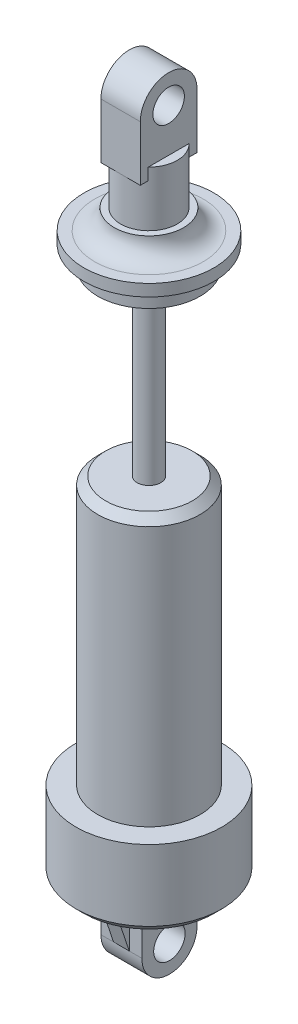
ISO-10303-21;
HEADER;
FILE_DESCRIPTION(('STEP AP214'),'2;1');
FILE_NAME('part.step','',(''),(''),'','','');
FILE_SCHEMA(('AUTOMOTIVE_DESIGN { 1 0 10303 214 1 1 1 1 }'));
ENDSEC;
DATA;
#1=APPLICATION_CONTEXT('core data for automotive mechanical design processes');
#2=APPLICATION_PROTOCOL_DEFINITION('international standard','automotive_design',2000,#1);
#3=PRODUCT_CONTEXT('',#1,'mechanical');
#4=PRODUCT('Part','Part','',(#3));
#5=PRODUCT_RELATED_PRODUCT_CATEGORY('part','',(#4));
#6=PRODUCT_DEFINITION_FORMATION('','',#4);
#7=PRODUCT_DEFINITION_CONTEXT('part definition',#1,'design');
#8=PRODUCT_DEFINITION('design','',#6,#7);
#9=PRODUCT_DEFINITION_SHAPE('','',#8);
#10=(LENGTH_UNIT() NAMED_UNIT(*) SI_UNIT(.MILLI.,.METRE.));
#11=(NAMED_UNIT(*) PLANE_ANGLE_UNIT() SI_UNIT($,.RADIAN.));
#12=(NAMED_UNIT(*) SI_UNIT($,.STERADIAN.) SOLID_ANGLE_UNIT());
#13=UNCERTAINTY_MEASURE_WITH_UNIT(LENGTH_MEASURE(1.E-05),#10,'distance_accuracy_value','');
#14=(GEOMETRIC_REPRESENTATION_CONTEXT(3) GLOBAL_UNCERTAINTY_ASSIGNED_CONTEXT((#13)) GLOBAL_UNIT_ASSIGNED_CONTEXT((#10,
#11,#12)) REPRESENTATION_CONTEXT('',''));
#15=CARTESIAN_POINT('',(0.,0.,0.));
#16=DIRECTION('',(0.,0.,1.));
#17=DIRECTION('',(1.,0.,0.));
#18=AXIS2_PLACEMENT_3D('',#15,#16,#17);
#19=CARTESIAN_POINT('',(0.,80.5,0.));
#20=DIRECTION('',(0.,-1.,0.));
#21=DIRECTION('',(0.,0.,-1.));
#22=AXIS2_PLACEMENT_3D('',#19,#20,#21);
#23=CYLINDRICAL_SURFACE('',#22,3.6);
#24=CARTESIAN_POINT('',(0.,73.5,0.));
#25=DIRECTION('',(0.,1.,0.));
#26=DIRECTION('',(0.,0.,1.));
#27=AXIS2_PLACEMENT_3D('',#24,#25,#26);
#28=CIRCLE('',#27,3.6);
#29=CARTESIAN_POINT('',(0.,73.5,3.6));
#30=VERTEX_POINT('',#29);
#31=EDGE_CURVE('E232',#30,#30,#28,.T.);
#32=ORIENTED_EDGE('',*,*,#31,.T.);
#33=EDGE_LOOP('',(#32));
#34=FACE_BOUND('',#33,.T.);
#35=CARTESIAN_POINT('',(0.,79.,0.));
#36=DIRECTION('',(0.,-1.,0.));
#37=DIRECTION('',(0.,0.,-1.));
#38=AXIS2_PLACEMENT_3D('',#35,#36,#37);
#39=CIRCLE('',#38,3.6);
#40=CARTESIAN_POINT('',(2.5,79.,2.59036676939772));
#41=VERTEX_POINT('',#40);
#42=CARTESIAN_POINT('',(0.,79.,3.6));
#43=VERTEX_POINT('',#42);
#44=EDGE_CURVE('E373',#41,#43,#39,.T.);
#45=ORIENTED_EDGE('',*,*,#44,.T.);
#46=CARTESIAN_POINT('',(-2.5,79.,2.59036676939772));
#47=VERTEX_POINT('',#46);
#48=EDGE_CURVE('E11',#43,#47,#39,.T.);
#49=ORIENTED_EDGE('',*,*,#48,.T.);
#50=DIRECTION('',(0.,-1.,0.));
#51=VECTOR('',#50,1.);
#52=CARTESIAN_POINT('',(-2.5,80.5,2.59036676939772));
#53=LINE('',#52,#51);
#54=CARTESIAN_POINT('',(-2.5,80.5,2.59036676939772));
#55=VERTEX_POINT('',#54);
#56=EDGE_CURVE('E230',#55,#47,#53,.T.);
#57=ORIENTED_EDGE('',*,*,#56,.F.);
#58=CARTESIAN_POINT('',(0.,80.5,0.));
#59=DIRECTION('',(0.,1.,0.));
#60=DIRECTION('',(0.,0.,1.));
#61=AXIS2_PLACEMENT_3D('',#58,#59,#60);
#62=CIRCLE('',#61,3.6);
#63=CARTESIAN_POINT('',(-2.5,80.5,-2.59036676939772));
#64=VERTEX_POINT('',#63);
#65=EDGE_CURVE('E233',#64,#55,#62,.T.);
#66=ORIENTED_EDGE('',*,*,#65,.F.);
#67=DIRECTION('',(0.,-1.,0.));
#68=VECTOR('',#67,1.);
#69=CARTESIAN_POINT('',(-2.5,80.5,-2.59036676939772));
#70=LINE('',#69,#68);
#71=CARTESIAN_POINT('',(-2.5,79.,-2.59036676939772));
#72=VERTEX_POINT('',#71);
#73=EDGE_CURVE('E58',#72,#64,#70,.F.);
#74=ORIENTED_EDGE('',*,*,#73,.F.);
#75=CARTESIAN_POINT('',(0.,79.,-3.6));
#76=VERTEX_POINT('',#75);
#77=EDGE_CURVE('E46',#72,#76,#39,.T.);
#78=ORIENTED_EDGE('',*,*,#77,.T.);
#79=CARTESIAN_POINT('',(2.5,79.,-2.59036676939772));
#80=VERTEX_POINT('',#79);
#81=EDGE_CURVE('E41',#76,#80,#39,.T.);
#82=ORIENTED_EDGE('',*,*,#81,.T.);
#83=DIRECTION('',(0.,-1.,0.));
#84=VECTOR('',#83,1.);
#85=CARTESIAN_POINT('',(2.5,80.5,-2.59036676939772));
#86=LINE('',#85,#84);
#87=CARTESIAN_POINT('',(2.5,80.5,-2.59036676939772));
#88=VERTEX_POINT('',#87);
#89=EDGE_CURVE('E218',#80,#88,#86,.F.);
#90=ORIENTED_EDGE('',*,*,#89,.T.);
#91=CARTESIAN_POINT('',(2.5,80.5,2.59036676939772));
#92=VERTEX_POINT('',#91);
#93=EDGE_CURVE('E236',#92,#88,#62,.T.);
#94=ORIENTED_EDGE('',*,*,#93,.F.);
#95=DIRECTION('',(0.,-1.,0.));
#96=VECTOR('',#95,1.);
#97=CARTESIAN_POINT('',(2.5,80.5,2.59036676939772));
#98=LINE('',#97,#96);
#99=EDGE_CURVE('E227',#92,#41,#98,.T.);
#100=ORIENTED_EDGE('',*,*,#99,.T.);
#101=EDGE_LOOP('',(#45,#49,#57,#66,#74,#78,#82,#90,#94,#100));
#102=FACE_BOUND('',#101,.T.);
#103=ADVANCED_FACE('F37',(#34,#102),#23,.T.);
#104=CARTESIAN_POINT('',(0.,80.5,0.));
#105=DIRECTION('',(0.,1.,0.));
#106=DIRECTION('',(0.,0.,1.));
#107=AXIS2_PLACEMENT_3D('',#104,#105,#106);
#108=PLANE('',#107);
#109=ORIENTED_EDGE('',*,*,#65,.T.);
#110=DIRECTION('',(0.,0.,-1.));
#111=VECTOR('',#110,1.);
#112=CARTESIAN_POINT('',(-2.5,80.5,0.));
#113=LINE('',#112,#111);
#114=EDGE_CURVE('E370',#55,#64,#113,.T.);
#115=ORIENTED_EDGE('',*,*,#114,.T.);
#116=EDGE_LOOP('',(#109,#115));
#117=FACE_BOUND('',#116,.T.);
#118=ADVANCED_FACE('F400',(#117),#108,.T.);
#119=CARTESIAN_POINT('',(0.,0.,0.));
#120=DIRECTION('',(0.,1.,0.));
#121=DIRECTION('',(0.,0.,1.));
#122=AXIS2_PLACEMENT_3D('',#119,#120,#121);
#123=PLANE('',#122);
#124=CARTESIAN_POINT('',(0.,0.,0.));
#125=DIRECTION('',(0.,1.,0.));
#126=DIRECTION('',(0.,0.,1.));
#127=AXIS2_PLACEMENT_3D('',#124,#125,#126);
#128=CIRCLE('',#127,8.25);
#129=CARTESIAN_POINT('',(0.,0.,8.25));
#130=VERTEX_POINT('',#129);
#131=EDGE_CURVE('E267',#130,#130,#128,.F.);
#132=ORIENTED_EDGE('',*,*,#131,.T.);
#133=EDGE_LOOP('',(#132));
#134=FACE_BOUND('',#133,.T.);
#135=DIRECTION('',(0.,0.,1.));
#136=VECTOR('',#135,1.);
#137=CARTESIAN_POINT('',(-1.,0.,-5.5));
#138=LINE('',#137,#136);
#139=CARTESIAN_POINT('',(-1.,0.,-5.5));
#140=VERTEX_POINT('',#139);
#141=CARTESIAN_POINT('',(-1.,0.,-3.5));
#142=VERTEX_POINT('',#141);
#143=EDGE_CURVE('E274',#140,#142,#138,.T.);
#144=ORIENTED_EDGE('',*,*,#143,.T.);
#145=DIRECTION('',(1.,0.,0.));
#146=VECTOR('',#145,1.);
#147=CARTESIAN_POINT('',(-2.6,0.,-3.5));
#148=LINE('',#147,#146);
#149=CARTESIAN_POINT('',(-2.6,0.,-3.5));
#150=VERTEX_POINT('',#149);
#151=EDGE_CURVE('E348',#150,#142,#148,.T.);
#152=ORIENTED_EDGE('',*,*,#151,.F.);
#153=DIRECTION('',(0.,0.,-1.));
#154=VECTOR('',#153,1.);
#155=CARTESIAN_POINT('',(-2.6,0.,0.));
#156=LINE('',#155,#154);
#157=CARTESIAN_POINT('',(-2.6,0.,3.5));
#158=VERTEX_POINT('',#157);
#159=EDGE_CURVE('E329',#158,#150,#156,.T.);
#160=ORIENTED_EDGE('',*,*,#159,.F.);
#161=DIRECTION('',(1.,0.,0.));
#162=VECTOR('',#161,1.);
#163=CARTESIAN_POINT('',(-2.6,0.,3.5));
#164=LINE('',#163,#162);
#165=CARTESIAN_POINT('',(-1.,0.,3.5));
#166=VERTEX_POINT('',#165);
#167=EDGE_CURVE('E344',#158,#166,#164,.T.);
#168=ORIENTED_EDGE('',*,*,#167,.T.);
#169=DIRECTION('',(0.,0.,1.));
#170=VECTOR('',#169,1.);
#171=CARTESIAN_POINT('',(-1.,0.,5.5));
#172=LINE('',#171,#170);
#173=CARTESIAN_POINT('',(-1.,0.,5.5));
#174=VERTEX_POINT('',#173);
#175=EDGE_CURVE('E297',#166,#174,#172,.T.);
#176=ORIENTED_EDGE('',*,*,#175,.T.);
#177=DIRECTION('',(1.,0.,0.));
#178=VECTOR('',#177,1.);
#179=CARTESIAN_POINT('',(-1.,0.,5.5));
#180=LINE('',#179,#178);
#181=CARTESIAN_POINT('',(1.,0.,5.5));
#182=VERTEX_POINT('',#181);
#183=EDGE_CURVE('E304',#174,#182,#180,.T.);
#184=ORIENTED_EDGE('',*,*,#183,.T.);
#185=DIRECTION('',(0.,0.,1.));
#186=VECTOR('',#185,1.);
#187=CARTESIAN_POINT('',(1.,0.,5.5));
#188=LINE('',#187,#186);
#189=CARTESIAN_POINT('',(1.,0.,3.5));
#190=VERTEX_POINT('',#189);
#191=EDGE_CURVE('E286',#190,#182,#188,.T.);
#192=ORIENTED_EDGE('',*,*,#191,.F.);
#193=CARTESIAN_POINT('',(2.6,0.,3.5));
#194=VERTEX_POINT('',#193);
#195=EDGE_CURVE('E347',#190,#194,#164,.T.);
#196=ORIENTED_EDGE('',*,*,#195,.T.);
#197=DIRECTION('',(0.,0.,-1.));
#198=VECTOR('',#197,1.);
#199=CARTESIAN_POINT('',(2.6,0.,0.));
#200=LINE('',#199,#198);
#201=CARTESIAN_POINT('',(2.6,0.,-3.5));
#202=VERTEX_POINT('',#201);
#203=EDGE_CURVE('E315',#194,#202,#200,.T.);
#204=ORIENTED_EDGE('',*,*,#203,.T.);
#205=CARTESIAN_POINT('',(1.,0.,-3.5));
#206=VERTEX_POINT('',#205);
#207=EDGE_CURVE('E351',#206,#202,#148,.T.);
#208=ORIENTED_EDGE('',*,*,#207,.F.);
#209=DIRECTION('',(0.,0.,1.));
#210=VECTOR('',#209,1.);
#211=CARTESIAN_POINT('',(1.,0.,-5.5));
#212=LINE('',#211,#210);
#213=CARTESIAN_POINT('',(1.,0.,-5.5));
#214=VERTEX_POINT('',#213);
#215=EDGE_CURVE('E257',#214,#206,#212,.T.);
#216=ORIENTED_EDGE('',*,*,#215,.F.);
#217=DIRECTION('',(1.,0.,0.));
#218=VECTOR('',#217,1.);
#219=CARTESIAN_POINT('',(-1.,0.,-5.5));
#220=LINE('',#219,#218);
#221=EDGE_CURVE('E284',#140,#214,#220,.T.);
#222=ORIENTED_EDGE('',*,*,#221,.F.);
#223=EDGE_LOOP('',(#144,#152,#160,#168,#176,#184,#192,#196,#204,#208,#216,#222));
#224=FACE_BOUND('',#223,.T.);
#225=ADVANCED_FACE('F411',(#134,#224),#123,.F.);
#226=CARTESIAN_POINT('',(-2.6,0.,-3.5));
#227=DIRECTION('',(0.,0.,1.));
#228=DIRECTION('',(1.,0.,0.));
#229=AXIS2_PLACEMENT_3D('',#226,#227,#228);
#230=PLANE('',#229);
#231=DIRECTION('',(0.,-1.,0.));
#232=VECTOR('',#231,1.);
#233=CARTESIAN_POINT('',(-1.,0.,-3.5));
#234=LINE('',#233,#232);
#235=CARTESIAN_POINT('',(-1.,-6.,-3.5));
#236=VERTEX_POINT('',#235);
#237=EDGE_CURVE('E277',#142,#236,#234,.T.);
#238=ORIENTED_EDGE('',*,*,#237,.T.);
#239=DIRECTION('',(1.,0.,0.));
#240=VECTOR('',#239,1.);
#241=CARTESIAN_POINT('',(-2.6,-6.,-3.5));
#242=LINE('',#241,#240);
#243=CARTESIAN_POINT('',(-2.6,-6.,-3.5));
#244=VERTEX_POINT('',#243);
#245=EDGE_CURVE('E352',#244,#236,#242,.T.);
#246=ORIENTED_EDGE('',*,*,#245,.F.);
#247=DIRECTION('',(0.,-1.,0.));
#248=VECTOR('',#247,1.);
#249=CARTESIAN_POINT('',(-2.6,0.,-3.5));
#250=LINE('',#249,#248);
#251=EDGE_CURVE('E327',#150,#244,#250,.T.);
#252=ORIENTED_EDGE('',*,*,#251,.F.);
#253=ORIENTED_EDGE('',*,*,#151,.T.);
#254=EDGE_LOOP('',(#238,#246,#252,#253));
#255=FACE_BOUND('',#254,.T.);
#256=ADVANCED_FACE('F499',(#255),#230,.F.);
#257=CARTESIAN_POINT('',(-2.6,0.,3.5));
#258=DIRECTION('',(0.,0.,-1.));
#259=DIRECTION('',(-1.,0.,0.));
#260=AXIS2_PLACEMENT_3D('',#257,#258,#259);
#261=PLANE('',#260);
#262=DIRECTION('',(0.,1.,0.));
#263=VECTOR('',#262,1.);
#264=CARTESIAN_POINT('',(1.,0.,3.5));
#265=LINE('',#264,#263);
#266=CARTESIAN_POINT('',(1.,-6.,3.5));
#267=VERTEX_POINT('',#266);
#268=EDGE_CURVE('E294',#267,#190,#265,.T.);
#269=ORIENTED_EDGE('',*,*,#268,.F.);
#270=DIRECTION('',(1.,0.,0.));
#271=VECTOR('',#270,1.);
#272=CARTESIAN_POINT('',(-2.6,-6.,3.5));
#273=LINE('',#272,#271);
#274=CARTESIAN_POINT('',(2.6,-6.,3.5));
#275=VERTEX_POINT('',#274);
#276=EDGE_CURVE('E343',#267,#275,#273,.T.);
#277=ORIENTED_EDGE('',*,*,#276,.T.);
#278=DIRECTION('',(0.,1.,0.));
#279=VECTOR('',#278,1.);
#280=CARTESIAN_POINT('',(2.6,0.,3.5));
#281=LINE('',#280,#279);
#282=EDGE_CURVE('E318',#275,#194,#281,.T.);
#283=ORIENTED_EDGE('',*,*,#282,.T.);
#284=ORIENTED_EDGE('',*,*,#195,.F.);
#285=EDGE_LOOP('',(#269,#277,#283,#284));
#286=FACE_BOUND('',#285,.T.);
#287=ADVANCED_FACE('F495',(#286),#261,.F.);
#288=CARTESIAN_POINT('',(0.,10.,0.));
#289=DIRECTION('',(0.,-1.,0.));
#290=DIRECTION('',(0.,0.,-1.));
#291=AXIS2_PLACEMENT_3D('',#288,#289,#290);
#292=CYLINDRICAL_SURFACE('',#291,9.25);
#293=CARTESIAN_POINT('',(0.,0.999999999999994,0.));
#294=DIRECTION('',(0.,1.,0.));
#295=DIRECTION('',(0.,0.,1.));
#296=AXIS2_PLACEMENT_3D('',#293,#294,#295);
#297=CIRCLE('',#296,9.25);
#298=CARTESIAN_POINT('',(0.,0.999999999999994,9.25));
#299=VERTEX_POINT('',#298);
#300=EDGE_CURVE('E357',#299,#299,#297,.T.);
#301=ORIENTED_EDGE('',*,*,#300,.T.);
#302=EDGE_LOOP('',(#301));
#303=FACE_BOUND('',#302,.T.);
#304=CARTESIAN_POINT('',(0.,10.,0.));
#305=DIRECTION('',(0.,1.,0.));
#306=DIRECTION('',(0.,0.,1.));
#307=AXIS2_PLACEMENT_3D('',#304,#305,#306);
#308=CIRCLE('',#307,9.25);
#309=CARTESIAN_POINT('',(0.,10.,9.25));
#310=VERTEX_POINT('',#309);
#311=EDGE_CURVE('E342',#310,#310,#308,.T.);
#312=ORIENTED_EDGE('',*,*,#311,.F.);
#313=EDGE_LOOP('',(#312));
#314=FACE_BOUND('',#313,.T.);
#315=ADVANCED_FACE('F507',(#303,#314),#292,.T.);
#316=CARTESIAN_POINT('',(0.,10.,0.));
#317=DIRECTION('',(0.,1.,0.));
#318=DIRECTION('',(0.,0.,1.));
#319=AXIS2_PLACEMENT_3D('',#316,#317,#318);
#320=PLANE('',#319);
#321=CARTESIAN_POINT('',(0.,10.,0.));
#322=DIRECTION('',(0.,1.,0.));
#323=DIRECTION('',(0.,0.,1.));
#324=AXIS2_PLACEMENT_3D('',#321,#322,#323);
#325=CIRCLE('',#324,6.5);
#326=CARTESIAN_POINT('',(0.,10.,6.5));
#327=VERTEX_POINT('',#326);
#328=EDGE_CURVE('E263',#327,#327,#325,.T.);
#329=ORIENTED_EDGE('',*,*,#328,.F.);
#330=EDGE_LOOP('',(#329));
#331=FACE_BOUND('',#330,.T.);
#332=ORIENTED_EDGE('',*,*,#311,.T.);
#333=EDGE_LOOP('',(#332));
#334=FACE_BOUND('',#333,.T.);
#335=ADVANCED_FACE('F504',(#331,#334),#320,.T.);
#336=CARTESIAN_POINT('',(0.,0.999999999999994,0.));
#337=DIRECTION('',(0.,1.,0.));
#338=DIRECTION('',(0.,0.,1.));
#339=AXIS2_PLACEMENT_3D('',#336,#337,#338);
#340=CONICAL_SURFACE('',#339,9.25,0.785398163397449);
#341=ORIENTED_EDGE('',*,*,#131,.F.);
#342=EDGE_LOOP('',(#341));
#343=FACE_BOUND('',#342,.T.);
#344=ORIENTED_EDGE('',*,*,#300,.F.);
#345=EDGE_LOOP('',(#344));
#346=FACE_BOUND('',#345,.T.);
#347=ADVANCED_FACE('F502',(#343,#346),#340,.T.);
#348=CARTESIAN_POINT('',(-2.6,-6.,0.));
#349=DIRECTION('',(1.,0.,0.));
#350=DIRECTION('',(0.,0.,-1.));
#351=AXIS2_PLACEMENT_3D('',#348,#349,#350);
#352=CYLINDRICAL_SURFACE('',#351,3.5);
#353=ORIENTED_EDGE('',*,*,#245,.T.);
#354=DIRECTION('',(1.,0.,0.));
#355=VECTOR('',#354,1.);
#356=CARTESIAN_POINT('',(-1.,-6.,-3.5));
#357=LINE('',#356,#355);
#358=CARTESIAN_POINT('',(1.,-6.,-3.5));
#359=VERTEX_POINT('',#358);
#360=EDGE_CURVE('E283',#236,#359,#357,.T.);
#361=ORIENTED_EDGE('',*,*,#360,.T.);
#362=CARTESIAN_POINT('',(2.6,-6.,-3.5));
#363=VERTEX_POINT('',#362);
#364=EDGE_CURVE('E338',#359,#363,#242,.T.);
#365=ORIENTED_EDGE('',*,*,#364,.T.);
#366=CARTESIAN_POINT('',(2.6,-6.,0.));
#367=DIRECTION('',(1.,0.,0.));
#368=DIRECTION('',(0.,0.,-1.));
#369=AXIS2_PLACEMENT_3D('',#366,#367,#368);
#370=CIRCLE('',#369,3.5);
#371=EDGE_CURVE('E308',#275,#363,#370,.T.);
#372=ORIENTED_EDGE('',*,*,#371,.F.);
#373=ORIENTED_EDGE('',*,*,#276,.F.);
#374=DIRECTION('',(1.,0.,0.));
#375=VECTOR('',#374,1.);
#376=CARTESIAN_POINT('',(-1.,-6.,3.5));
#377=LINE('',#376,#375);
#378=CARTESIAN_POINT('',(-1.,-6.,3.5));
#379=VERTEX_POINT('',#378);
#380=EDGE_CURVE('E305',#379,#267,#377,.T.);
#381=ORIENTED_EDGE('',*,*,#380,.F.);
#382=CARTESIAN_POINT('',(-2.6,-6.,3.5));
#383=VERTEX_POINT('',#382);
#384=EDGE_CURVE('E339',#383,#379,#273,.T.);
#385=ORIENTED_EDGE('',*,*,#384,.F.);
#386=CARTESIAN_POINT('',(-2.6,-6.,0.));
#387=DIRECTION('',(1.,0.,0.));
#388=DIRECTION('',(0.,0.,-1.));
#389=AXIS2_PLACEMENT_3D('',#386,#387,#388);
#390=CIRCLE('',#389,3.5);
#391=EDGE_CURVE('E324',#383,#244,#390,.T.);
#392=ORIENTED_EDGE('',*,*,#391,.T.);
#393=EDGE_LOOP('',(#353,#361,#365,#372,#373,#381,#385,#392));
#394=FACE_BOUND('',#393,.T.);
#395=ADVANCED_FACE('F493',(#394),#352,.T.);
#396=ORIENTED_EDGE('',*,*,#384,.T.);
#397=DIRECTION('',(0.,1.,0.));
#398=VECTOR('',#397,1.);
#399=CARTESIAN_POINT('',(-1.,0.,3.5));
#400=LINE('',#399,#398);
#401=EDGE_CURVE('E302',#379,#166,#400,.T.);
#402=ORIENTED_EDGE('',*,*,#401,.T.);
#403=ORIENTED_EDGE('',*,*,#167,.F.);
#404=DIRECTION('',(0.,1.,0.));
#405=VECTOR('',#404,1.);
#406=CARTESIAN_POINT('',(-2.6,0.,3.5));
#407=LINE('',#406,#405);
#408=EDGE_CURVE('E332',#383,#158,#407,.T.);
#409=ORIENTED_EDGE('',*,*,#408,.F.);
#410=EDGE_LOOP('',(#396,#402,#403,#409));
#411=FACE_BOUND('',#410,.T.);
#412=ADVANCED_FACE('F490',(#411),#261,.F.);
#413=ORIENTED_EDGE('',*,*,#364,.F.);
#414=DIRECTION('',(0.,-1.,0.));
#415=VECTOR('',#414,1.);
#416=CARTESIAN_POINT('',(1.,0.,-3.5));
#417=LINE('',#416,#415);
#418=EDGE_CURVE('E269',#206,#359,#417,.T.);
#419=ORIENTED_EDGE('',*,*,#418,.F.);
#420=ORIENTED_EDGE('',*,*,#207,.T.);
#421=DIRECTION('',(0.,-1.,0.));
#422=VECTOR('',#421,1.);
#423=CARTESIAN_POINT('',(2.6,0.,-3.5));
#424=LINE('',#423,#422);
#425=EDGE_CURVE('E312',#202,#363,#424,.T.);
#426=ORIENTED_EDGE('',*,*,#425,.T.);
#427=EDGE_LOOP('',(#413,#419,#420,#426));
#428=FACE_BOUND('',#427,.T.);
#429=ADVANCED_FACE('F488',(#428),#230,.F.);
#430=CARTESIAN_POINT('',(-2.6,-6.,0.));
#431=DIRECTION('',(1.,0.,0.));
#432=DIRECTION('',(0.,0.,-1.));
#433=AXIS2_PLACEMENT_3D('',#430,#431,#432);
#434=CYLINDRICAL_SURFACE('',#433,2.);
#435=CARTESIAN_POINT('',(-2.6,-6.,0.));
#436=DIRECTION('',(1.,0.,0.));
#437=DIRECTION('',(0.,0.,-1.));
#438=AXIS2_PLACEMENT_3D('',#435,#436,#437);
#439=CIRCLE('',#438,2.);
#440=CARTESIAN_POINT('',(-2.6,-6.,-2.));
#441=VERTEX_POINT('',#440);
#442=EDGE_CURVE('E335',#441,#441,#439,.T.);
#443=ORIENTED_EDGE('',*,*,#442,.F.);
#444=EDGE_LOOP('',(#443));
#445=FACE_BOUND('',#444,.T.);
#446=CARTESIAN_POINT('',(2.6,-6.,0.));
#447=DIRECTION('',(1.,0.,0.));
#448=DIRECTION('',(0.,0.,-1.));
#449=AXIS2_PLACEMENT_3D('',#446,#447,#448);
#450=CIRCLE('',#449,2.);
#451=CARTESIAN_POINT('',(2.6,-6.,-2.));
#452=VERTEX_POINT('',#451);
#453=EDGE_CURVE('E321',#452,#452,#450,.T.);
#454=ORIENTED_EDGE('',*,*,#453,.T.);
#455=EDGE_LOOP('',(#454));
#456=FACE_BOUND('',#455,.T.);
#457=ADVANCED_FACE('F484',(#445,#456),#434,.F.);
#458=CARTESIAN_POINT('',(-2.6,0.,0.));
#459=DIRECTION('',(1.,0.,0.));
#460=DIRECTION('',(0.,0.,-1.));
#461=AXIS2_PLACEMENT_3D('',#458,#459,#460);
#462=PLANE('',#461);
#463=ORIENTED_EDGE('',*,*,#391,.F.);
#464=ORIENTED_EDGE('',*,*,#408,.T.);
#465=ORIENTED_EDGE('',*,*,#159,.T.);
#466=ORIENTED_EDGE('',*,*,#251,.T.);
#467=EDGE_LOOP('',(#463,#464,#465,#466));
#468=FACE_BOUND('',#467,.T.);
#469=ORIENTED_EDGE('',*,*,#442,.T.);
#470=EDGE_LOOP('',(#469));
#471=FACE_BOUND('',#470,.T.);
#472=ADVANCED_FACE('F480',(#468,#471),#462,.F.);
#473=CARTESIAN_POINT('',(2.6,0.,0.));
#474=DIRECTION('',(1.,0.,0.));
#475=DIRECTION('',(0.,0.,-1.));
#476=AXIS2_PLACEMENT_3D('',#473,#474,#475);
#477=PLANE('',#476);
#478=ORIENTED_EDGE('',*,*,#371,.T.);
#479=ORIENTED_EDGE('',*,*,#425,.F.);
#480=ORIENTED_EDGE('',*,*,#203,.F.);
#481=ORIENTED_EDGE('',*,*,#282,.F.);
#482=EDGE_LOOP('',(#478,#479,#480,#481));
#483=FACE_BOUND('',#482,.T.);
#484=ORIENTED_EDGE('',*,*,#453,.F.);
#485=EDGE_LOOP('',(#484));
#486=FACE_BOUND('',#485,.T.);
#487=ADVANCED_FACE('F476',(#483,#486),#477,.T.);
#488=CARTESIAN_POINT('',(-1.,-6.,3.5));
#489=DIRECTION('',(0.,-0.316227766016838,0.948683298050514));
#490=DIRECTION('',(0.,-0.948683298050514,-0.316227766016838));
#491=AXIS2_PLACEMENT_3D('',#488,#489,#490);
#492=PLANE('',#491);
#493=ORIENTED_EDGE('',*,*,#380,.T.);
#494=DIRECTION('',(0.,-0.948683298050514,-0.316227766016838));
#495=VECTOR('',#494,1.);
#496=CARTESIAN_POINT('',(1.,-6.,3.5));
#497=LINE('',#496,#495);
#498=EDGE_CURVE('E291',#182,#267,#497,.T.);
#499=ORIENTED_EDGE('',*,*,#498,.F.);
#500=ORIENTED_EDGE('',*,*,#183,.F.);
#501=DIRECTION('',(0.,-0.948683298050514,-0.316227766016838));
#502=VECTOR('',#501,1.);
#503=CARTESIAN_POINT('',(-1.,-6.,3.5));
#504=LINE('',#503,#502);
#505=EDGE_CURVE('E299',#174,#379,#504,.T.);
#506=ORIENTED_EDGE('',*,*,#505,.T.);
#507=EDGE_LOOP('',(#493,#499,#500,#506));
#508=FACE_BOUND('',#507,.T.);
#509=ADVANCED_FACE('F472',(#508),#492,.T.);
#510=CARTESIAN_POINT('',(-1.,0.,0.));
#511=DIRECTION('',(-1.,0.,0.));
#512=DIRECTION('',(0.,0.,1.));
#513=AXIS2_PLACEMENT_3D('',#510,#511,#512);
#514=PLANE('',#513);
#515=ORIENTED_EDGE('',*,*,#175,.F.);
#516=ORIENTED_EDGE('',*,*,#401,.F.);
#517=ORIENTED_EDGE('',*,*,#505,.F.);
#518=EDGE_LOOP('',(#515,#516,#517));
#519=FACE_BOUND('',#518,.T.);
#520=ADVANCED_FACE('F468',(#519),#514,.T.);
#521=CARTESIAN_POINT('',(1.,0.,0.));
#522=DIRECTION('',(-1.,0.,0.));
#523=DIRECTION('',(0.,0.,1.));
#524=AXIS2_PLACEMENT_3D('',#521,#522,#523);
#525=PLANE('',#524);
#526=ORIENTED_EDGE('',*,*,#191,.T.);
#527=ORIENTED_EDGE('',*,*,#498,.T.);
#528=ORIENTED_EDGE('',*,*,#268,.T.);
#529=EDGE_LOOP('',(#526,#527,#528));
#530=FACE_BOUND('',#529,.T.);
#531=ADVANCED_FACE('F464',(#530),#525,.F.);
#532=CARTESIAN_POINT('',(-1.,-6.,-3.5));
#533=DIRECTION('',(0.,-0.316227766016838,-0.948683298050514));
#534=DIRECTION('',(0.,0.948683298050514,-0.316227766016838));
#535=AXIS2_PLACEMENT_3D('',#532,#533,#534);
#536=PLANE('',#535);
#537=ORIENTED_EDGE('',*,*,#221,.T.);
#538=DIRECTION('',(0.,0.948683298050514,-0.316227766016838));
#539=VECTOR('',#538,1.);
#540=CARTESIAN_POINT('',(1.,-6.,-3.5));
#541=LINE('',#540,#539);
#542=EDGE_CURVE('E271',#359,#214,#541,.T.);
#543=ORIENTED_EDGE('',*,*,#542,.F.);
#544=ORIENTED_EDGE('',*,*,#360,.F.);
#545=DIRECTION('',(0.,0.948683298050514,-0.316227766016838));
#546=VECTOR('',#545,1.);
#547=CARTESIAN_POINT('',(-1.,-6.,-3.5));
#548=LINE('',#547,#546);
#549=EDGE_CURVE('E280',#236,#140,#548,.T.);
#550=ORIENTED_EDGE('',*,*,#549,.T.);
#551=EDGE_LOOP('',(#537,#543,#544,#550));
#552=FACE_BOUND('',#551,.T.);
#553=ADVANCED_FACE('F460',(#552),#536,.T.);
#554=CARTESIAN_POINT('',(-1.,0.,0.));
#555=DIRECTION('',(1.,0.,0.));
#556=DIRECTION('',(0.,0.,-1.));
#557=AXIS2_PLACEMENT_3D('',#554,#555,#556);
#558=PLANE('',#557);
#559=ORIENTED_EDGE('',*,*,#143,.F.);
#560=ORIENTED_EDGE('',*,*,#549,.F.);
#561=ORIENTED_EDGE('',*,*,#237,.F.);
#562=EDGE_LOOP('',(#559,#560,#561));
#563=FACE_BOUND('',#562,.T.);
#564=ADVANCED_FACE('F456',(#563),#558,.F.);
#565=CARTESIAN_POINT('',(1.,0.,0.));
#566=DIRECTION('',(1.,0.,0.));
#567=DIRECTION('',(0.,0.,-1.));
#568=AXIS2_PLACEMENT_3D('',#565,#566,#567);
#569=PLANE('',#568);
#570=ORIENTED_EDGE('',*,*,#215,.T.);
#571=ORIENTED_EDGE('',*,*,#418,.T.);
#572=ORIENTED_EDGE('',*,*,#542,.T.);
#573=EDGE_LOOP('',(#570,#571,#572));
#574=FACE_BOUND('',#573,.T.);
#575=ADVANCED_FACE('F452',(#574),#569,.T.);
#576=CARTESIAN_POINT('',(0.,44.,0.));
#577=DIRECTION('',(0.,-1.,0.));
#578=DIRECTION('',(0.,0.,-1.));
#579=AXIS2_PLACEMENT_3D('',#576,#577,#578);
#580=CYLINDRICAL_SURFACE('',#579,6.5);
#581=CARTESIAN_POINT('',(0.,43.,0.));
#582=DIRECTION('',(0.,1.,0.));
#583=DIRECTION('',(0.,0.,1.));
#584=AXIS2_PLACEMENT_3D('',#581,#582,#583);
#585=CIRCLE('',#584,6.5);
#586=CARTESIAN_POINT('',(0.,43.,6.5));
#587=VERTEX_POINT('',#586);
#588=EDGE_CURVE('E262',#587,#587,#585,.F.);
#589=ORIENTED_EDGE('',*,*,#588,.T.);
#590=EDGE_LOOP('',(#589));
#591=FACE_BOUND('',#590,.T.);
#592=ORIENTED_EDGE('',*,*,#328,.T.);
#593=EDGE_LOOP('',(#592));
#594=FACE_BOUND('',#593,.T.);
#595=ADVANCED_FACE('F448',(#591,#594),#580,.T.);
#596=CARTESIAN_POINT('',(0.,44.,0.));
#597=DIRECTION('',(0.,1.,0.));
#598=DIRECTION('',(0.,0.,1.));
#599=AXIS2_PLACEMENT_3D('',#596,#597,#598);
#600=PLANE('',#599);
#601=CARTESIAN_POINT('',(0.,44.,0.));
#602=DIRECTION('',(0.,1.,0.));
#603=DIRECTION('',(0.,0.,1.));
#604=AXIS2_PLACEMENT_3D('',#601,#602,#603);
#605=CIRCLE('',#604,1.5);
#606=CARTESIAN_POINT('',(0.,44.,1.5));
#607=VERTEX_POINT('',#606);
#608=EDGE_CURVE('E258',#607,#607,#605,.T.);
#609=ORIENTED_EDGE('',*,*,#608,.F.);
#610=EDGE_LOOP('',(#609));
#611=FACE_BOUND('',#610,.T.);
#612=CARTESIAN_POINT('',(0.,44.,0.));
#613=DIRECTION('',(0.,1.,0.));
#614=DIRECTION('',(0.,0.,1.));
#615=AXIS2_PLACEMENT_3D('',#612,#613,#614);
#616=CIRCLE('',#615,5.50000000000001);
#617=CARTESIAN_POINT('',(0.,44.,5.50000000000001));
#618=VERTEX_POINT('',#617);
#619=EDGE_CURVE('E266',#618,#618,#616,.T.);
#620=ORIENTED_EDGE('',*,*,#619,.T.);
#621=EDGE_LOOP('',(#620));
#622=FACE_BOUND('',#621,.T.);
#623=ADVANCED_FACE('F445',(#611,#622),#600,.T.);
#624=CARTESIAN_POINT('',(0.,44.,0.));
#625=DIRECTION('',(0.,-1.,0.));
#626=DIRECTION('',(0.,0.,-1.));
#627=AXIS2_PLACEMENT_3D('',#624,#625,#626);
#628=CONICAL_SURFACE('',#627,5.50000000000001,0.785398163397446);
#629=ORIENTED_EDGE('',*,*,#588,.F.);
#630=EDGE_LOOP('',(#629));
#631=FACE_BOUND('',#630,.T.);
#632=ORIENTED_EDGE('',*,*,#619,.F.);
#633=EDGE_LOOP('',(#632));
#634=FACE_BOUND('',#633,.T.);
#635=ADVANCED_FACE('F443',(#631,#634),#628,.T.);
#636=CARTESIAN_POINT('',(0.,67.,0.));
#637=DIRECTION('',(0.,-1.,0.));
#638=DIRECTION('',(0.,0.,-1.));
#639=AXIS2_PLACEMENT_3D('',#636,#637,#638);
#640=CYLINDRICAL_SURFACE('',#639,1.5);
#641=CARTESIAN_POINT('',(0.,67.,0.));
#642=DIRECTION('',(0.,1.,0.));
#643=DIRECTION('',(0.,0.,1.));
#644=AXIS2_PLACEMENT_3D('',#641,#642,#643);
#645=CIRCLE('',#644,1.5);
#646=CARTESIAN_POINT('',(0.,67.,1.5));
#647=VERTEX_POINT('',#646);
#648=EDGE_CURVE('E252',#647,#647,#645,.T.);
#649=ORIENTED_EDGE('',*,*,#648,.F.);
#650=EDGE_LOOP('',(#649));
#651=FACE_BOUND('',#650,.T.);
#652=ORIENTED_EDGE('',*,*,#608,.T.);
#653=EDGE_LOOP('',(#652));
#654=FACE_BOUND('',#653,.T.);
#655=ADVANCED_FACE('F439',(#651,#654),#640,.T.);
#656=CARTESIAN_POINT('',(0.,69.5,0.));
#657=DIRECTION('',(0.,-1.,0.));
#658=DIRECTION('',(0.,0.,-1.));
#659=AXIS2_PLACEMENT_3D('',#656,#657,#658);
#660=CYLINDRICAL_SURFACE('',#659,6.5);
#661=CARTESIAN_POINT('',(0.,69.5,0.));
#662=DIRECTION('',(0.,1.,0.));
#663=DIRECTION('',(0.,0.,1.));
#664=AXIS2_PLACEMENT_3D('',#661,#662,#663);
#665=CIRCLE('',#664,6.5);
#666=CARTESIAN_POINT('',(0.,69.5,6.5));
#667=VERTEX_POINT('',#666);
#668=EDGE_CURVE('E249',#667,#667,#665,.T.);
#669=ORIENTED_EDGE('',*,*,#668,.F.);
#670=EDGE_LOOP('',(#669));
#671=FACE_BOUND('',#670,.T.);
#672=CARTESIAN_POINT('',(0.,67.,0.));
#673=DIRECTION('',(0.,1.,0.));
#674=DIRECTION('',(0.,0.,1.));
#675=AXIS2_PLACEMENT_3D('',#672,#673,#674);
#676=CIRCLE('',#675,6.5);
#677=CARTESIAN_POINT('',(0.,67.,6.5));
#678=VERTEX_POINT('',#677);
#679=EDGE_CURVE('E246',#678,#678,#676,.T.);
#680=ORIENTED_EDGE('',*,*,#679,.T.);
#681=EDGE_LOOP('',(#680));
#682=FACE_BOUND('',#681,.T.);
#683=ADVANCED_FACE('F435',(#671,#682),#660,.T.);
#684=CARTESIAN_POINT('',(0.,67.,0.));
#685=DIRECTION('',(0.,1.,0.));
#686=DIRECTION('',(0.,0.,1.));
#687=AXIS2_PLACEMENT_3D('',#684,#685,#686);
#688=PLANE('',#687);
#689=ORIENTED_EDGE('',*,*,#648,.T.);
#690=EDGE_LOOP('',(#689));
#691=FACE_BOUND('',#690,.T.);
#692=ORIENTED_EDGE('',*,*,#679,.F.);
#693=EDGE_LOOP('',(#692));
#694=FACE_BOUND('',#693,.T.);
#695=ADVANCED_FACE('F431',(#691,#694),#688,.F.);
#696=CARTESIAN_POINT('',(0.,71.,0.));
#697=DIRECTION('',(0.,-1.,0.));
#698=DIRECTION('',(0.,0.,-1.));
#699=AXIS2_PLACEMENT_3D('',#696,#697,#698);
#700=CYLINDRICAL_SURFACE('',#699,8.25);
#701=CARTESIAN_POINT('',(0.,71.,0.));
#702=DIRECTION('',(0.,1.,0.));
#703=DIRECTION('',(0.,0.,1.));
#704=AXIS2_PLACEMENT_3D('',#701,#702,#703);
#705=CIRCLE('',#704,8.25);
#706=CARTESIAN_POINT('',(0.,71.,8.25));
#707=VERTEX_POINT('',#706);
#708=EDGE_CURVE('E243',#707,#707,#705,.T.);
#709=ORIENTED_EDGE('',*,*,#708,.F.);
#710=EDGE_LOOP('',(#709));
#711=FACE_BOUND('',#710,.T.);
#712=CARTESIAN_POINT('',(0.,69.5,0.));
#713=DIRECTION('',(0.,1.,0.));
#714=DIRECTION('',(0.,0.,1.));
#715=AXIS2_PLACEMENT_3D('',#712,#713,#714);
#716=CIRCLE('',#715,8.25);
#717=CARTESIAN_POINT('',(0.,69.5,8.25));
#718=VERTEX_POINT('',#717);
#719=EDGE_CURVE('E242',#718,#718,#716,.T.);
#720=ORIENTED_EDGE('',*,*,#719,.T.);
#721=EDGE_LOOP('',(#720));
#722=FACE_BOUND('',#721,.T.);
#723=ADVANCED_FACE('F424',(#711,#722),#700,.T.);
#724=CARTESIAN_POINT('',(0.,71.,0.));
#725=DIRECTION('',(0.,1.,0.));
#726=DIRECTION('',(0.,0.,1.));
#727=AXIS2_PLACEMENT_3D('',#724,#725,#726);
#728=PLANE('',#727);
#729=CARTESIAN_POINT('',(0.,71.,0.));
#730=DIRECTION('',(0.,1.,0.));
#731=DIRECTION('',(0.,0.,1.));
#732=AXIS2_PLACEMENT_3D('',#729,#730,#731);
#733=CIRCLE('',#732,6.9);
#734=CARTESIAN_POINT('',(0.,71.,6.9));
#735=VERTEX_POINT('',#734);
#736=EDGE_CURVE('E261',#735,#735,#733,.F.);
#737=ORIENTED_EDGE('',*,*,#736,.T.);
#738=EDGE_LOOP('',(#737));
#739=FACE_BOUND('',#738,.T.);
#740=ORIENTED_EDGE('',*,*,#708,.T.);
#741=EDGE_LOOP('',(#740));
#742=FACE_BOUND('',#741,.T.);
#743=ADVANCED_FACE('F421',(#739,#742),#728,.T.);
#744=CARTESIAN_POINT('',(0.,69.5,0.));
#745=DIRECTION('',(0.,1.,0.));
#746=DIRECTION('',(0.,0.,1.));
#747=AXIS2_PLACEMENT_3D('',#744,#745,#746);
#748=PLANE('',#747);
#749=ORIENTED_EDGE('',*,*,#668,.T.);
#750=EDGE_LOOP('',(#749));
#751=FACE_BOUND('',#750,.T.);
#752=ORIENTED_EDGE('',*,*,#719,.F.);
#753=EDGE_LOOP('',(#752));
#754=FACE_BOUND('',#753,.T.);
#755=ADVANCED_FACE('F419',(#751,#754),#748,.F.);
#756=CARTESIAN_POINT('',(0.,73.5,0.));
#757=DIRECTION('',(0.,1.,0.));
#758=DIRECTION('',(0.,0.,1.));
#759=AXIS2_PLACEMENT_3D('',#756,#757,#758);
#760=PLANE('',#759);
#761=ORIENTED_EDGE('',*,*,#31,.F.);
#762=EDGE_LOOP('',(#761));
#763=FACE_BOUND('',#762,.T.);
#764=CARTESIAN_POINT('',(0.,73.5,0.));
#765=DIRECTION('',(0.,1.,0.));
#766=DIRECTION('',(0.,0.,1.));
#767=AXIS2_PLACEMENT_3D('',#764,#765,#766);
#768=CIRCLE('',#767,4.4);
#769=CARTESIAN_POINT('',(0.,73.5,4.4));
#770=VERTEX_POINT('',#769);
#771=EDGE_CURVE('E239',#770,#770,#768,.T.);
#772=ORIENTED_EDGE('',*,*,#771,.T.);
#773=EDGE_LOOP('',(#772));
#774=FACE_BOUND('',#773,.T.);
#775=ADVANCED_FACE('F406',(#763,#774),#760,.T.);
#776=CARTESIAN_POINT('',(0.,73.5,0.));
#777=DIRECTION('',(0.,1.,0.));
#778=DIRECTION('',(0.,0.,1.));
#779=AXIS2_PLACEMENT_3D('',#776,#777,#778);
#780=TOROIDAL_SURFACE('',#779,6.9,2.5);
#781=ORIENTED_EDGE('',*,*,#736,.F.);
#782=EDGE_LOOP('',(#781));
#783=FACE_BOUND('',#782,.T.);
#784=ORIENTED_EDGE('',*,*,#771,.F.);
#785=EDGE_LOOP('',(#784));
#786=FACE_BOUND('',#785,.T.);
#787=ADVANCED_FACE('F39',(#783,#786),#780,.F.);
#788=DIRECTION('',(0.,0.,-1.));
#789=VECTOR('',#788,1.);
#790=CARTESIAN_POINT('',(2.5,80.5,0.));
#791=LINE('',#790,#789);
#792=EDGE_CURVE('E368',#92,#88,#791,.T.);
#793=ORIENTED_EDGE('',*,*,#792,.F.);
#794=ORIENTED_EDGE('',*,*,#93,.T.);
#795=EDGE_LOOP('',(#793,#794));
#796=FACE_BOUND('',#795,.T.);
#797=ADVANCED_FACE('F397',(#796),#108,.T.);
#798=CARTESIAN_POINT('',(-2.5,79.,0.));
#799=DIRECTION('',(0.,-1.,0.));
#800=DIRECTION('',(0.,0.,-1.));
#801=AXIS2_PLACEMENT_3D('',#798,#799,#800);
#802=PLANE('',#801);
#803=ORIENTED_EDGE('',*,*,#44,.F.);
#804=DIRECTION('',(0.,0.,-1.));
#805=VECTOR('',#804,1.);
#806=CARTESIAN_POINT('',(2.5,79.,0.));
#807=LINE('',#806,#805);
#808=CARTESIAN_POINT('',(2.5,79.,3.6));
#809=VERTEX_POINT('',#808);
#810=EDGE_CURVE('E201',#809,#41,#807,.T.);
#811=ORIENTED_EDGE('',*,*,#810,.F.);
#812=DIRECTION('',(1.,0.,0.));
#813=VECTOR('',#812,1.);
#814=CARTESIAN_POINT('',(-2.5,79.,3.6));
#815=LINE('',#814,#813);
#816=EDGE_CURVE('E177',#43,#809,#815,.T.);
#817=ORIENTED_EDGE('',*,*,#816,.F.);
#818=EDGE_LOOP('',(#803,#811,#817));
#819=FACE_BOUND('',#818,.T.);
#820=ADVANCED_FACE('F394',(#819),#802,.T.);
#821=ORIENTED_EDGE('',*,*,#48,.F.);
#822=CARTESIAN_POINT('',(-2.5,79.,3.6));
#823=VERTEX_POINT('',#822);
#824=EDGE_CURVE('E223',#823,#43,#815,.T.);
#825=ORIENTED_EDGE('',*,*,#824,.F.);
#826=DIRECTION('',(0.,0.,-1.));
#827=VECTOR('',#826,1.);
#828=CARTESIAN_POINT('',(-2.5,79.,0.));
#829=LINE('',#828,#827);
#830=EDGE_CURVE('E211',#823,#47,#829,.T.);
#831=ORIENTED_EDGE('',*,*,#830,.T.);
#832=EDGE_LOOP('',(#821,#825,#831));
#833=FACE_BOUND('',#832,.T.);
#834=ADVANCED_FACE('F392',(#833),#802,.T.);
#835=ORIENTED_EDGE('',*,*,#81,.F.);
#836=DIRECTION('',(1.,0.,0.));
#837=VECTOR('',#836,1.);
#838=CARTESIAN_POINT('',(-2.5,79.,-3.6));
#839=LINE('',#838,#837);
#840=CARTESIAN_POINT('',(2.5,79.,-3.6));
#841=VERTEX_POINT('',#840);
#842=EDGE_CURVE('E222',#76,#841,#839,.T.);
#843=ORIENTED_EDGE('',*,*,#842,.T.);
#844=EDGE_CURVE('E188',#80,#841,#807,.T.);
#845=ORIENTED_EDGE('',*,*,#844,.F.);
#846=EDGE_LOOP('',(#835,#843,#845));
#847=FACE_BOUND('',#846,.T.);
#848=ADVANCED_FACE('F382',(#847),#802,.T.);
#849=CARTESIAN_POINT('',(-2.5,0.,0.));
#850=DIRECTION('',(1.,0.,0.));
#851=DIRECTION('',(0.,0.,-1.));
#852=AXIS2_PLACEMENT_3D('',#849,#850,#851);
#853=PLANE('',#852);
#854=CARTESIAN_POINT('',(-2.5,86.,0.));
#855=DIRECTION('',(1.,0.,0.));
#856=DIRECTION('',(0.,0.,-1.));
#857=AXIS2_PLACEMENT_3D('',#854,#855,#856);
#858=CIRCLE('',#857,2.);
#859=CARTESIAN_POINT('',(-2.5,86.,-2.));
#860=VERTEX_POINT('',#859);
#861=EDGE_CURVE('E204',#860,#860,#858,.T.);
#862=ORIENTED_EDGE('',*,*,#861,.T.);
#863=EDGE_LOOP('',(#862));
#864=FACE_BOUND('',#863,.T.);
#865=ORIENTED_EDGE('',*,*,#114,.F.);
#866=ORIENTED_EDGE('',*,*,#56,.T.);
#867=ORIENTED_EDGE('',*,*,#830,.F.);
#868=DIRECTION('',(0.,-1.,0.));
#869=VECTOR('',#868,1.);
#870=CARTESIAN_POINT('',(-2.5,0.,3.59999999999997));
#871=LINE('',#870,#869);
#872=CARTESIAN_POINT('',(-2.5,86.,3.6));
#873=VERTEX_POINT('',#872);
#874=EDGE_CURVE('E208',#873,#823,#871,.T.);
#875=ORIENTED_EDGE('',*,*,#874,.F.);
#876=CARTESIAN_POINT('',(-2.5,86.,0.));
#877=DIRECTION('',(1.,0.,0.));
#878=DIRECTION('',(0.,0.,-1.));
#879=AXIS2_PLACEMENT_3D('',#876,#877,#878);
#880=CIRCLE('',#879,3.6);
#881=CARTESIAN_POINT('',(-2.5,86.,-3.6));
#882=VERTEX_POINT('',#881);
#883=EDGE_CURVE('E173',#882,#873,#880,.T.);
#884=ORIENTED_EDGE('',*,*,#883,.F.);
#885=DIRECTION('',(0.,1.,0.));
#886=VECTOR('',#885,1.);
#887=CARTESIAN_POINT('',(-2.5,0.,-3.59999999999998));
#888=LINE('',#887,#886);
#889=CARTESIAN_POINT('',(-2.5,79.,-3.6));
#890=VERTEX_POINT('',#889);
#891=EDGE_CURVE('E178',#890,#882,#888,.T.);
#892=ORIENTED_EDGE('',*,*,#891,.F.);
#893=EDGE_CURVE('E210',#72,#890,#829,.T.);
#894=ORIENTED_EDGE('',*,*,#893,.F.);
#895=ORIENTED_EDGE('',*,*,#73,.T.);
#896=EDGE_LOOP('',(#865,#866,#867,#875,#884,#892,#894,#895));
#897=FACE_BOUND('',#896,.T.);
#898=ADVANCED_FACE('F389',(#864,#897),#853,.F.);
#899=CARTESIAN_POINT('',(2.5,0.,0.));
#900=DIRECTION('',(1.,0.,0.));
#901=DIRECTION('',(0.,0.,-1.));
#902=AXIS2_PLACEMENT_3D('',#899,#900,#901);
#903=PLANE('',#902);
#904=CARTESIAN_POINT('',(2.5,86.,0.));
#905=DIRECTION('',(1.,0.,0.));
#906=DIRECTION('',(0.,0.,-1.));
#907=AXIS2_PLACEMENT_3D('',#904,#905,#906);
#908=CIRCLE('',#907,2.);
#909=CARTESIAN_POINT('',(2.5,86.,-2.));
#910=VERTEX_POINT('',#909);
#911=EDGE_CURVE('E196',#910,#910,#908,.T.);
#912=ORIENTED_EDGE('',*,*,#911,.F.);
#913=EDGE_LOOP('',(#912));
#914=FACE_BOUND('',#913,.T.);
#915=ORIENTED_EDGE('',*,*,#99,.F.);
#916=ORIENTED_EDGE('',*,*,#792,.T.);
#917=ORIENTED_EDGE('',*,*,#89,.F.);
#918=ORIENTED_EDGE('',*,*,#844,.T.);
#919=DIRECTION('',(0.,1.,0.));
#920=VECTOR('',#919,1.);
#921=CARTESIAN_POINT('',(2.5,0.,-3.59999999999998));
#922=LINE('',#921,#920);
#923=CARTESIAN_POINT('',(2.5,86.,-3.6));
#924=VERTEX_POINT('',#923);
#925=EDGE_CURVE('E195',#841,#924,#922,.T.);
#926=ORIENTED_EDGE('',*,*,#925,.T.);
#927=CARTESIAN_POINT('',(2.5,86.,0.));
#928=DIRECTION('',(1.,0.,0.));
#929=DIRECTION('',(0.,0.,-1.));
#930=AXIS2_PLACEMENT_3D('',#927,#928,#929);
#931=CIRCLE('',#930,3.6);
#932=CARTESIAN_POINT('',(2.5,86.,3.6));
#933=VERTEX_POINT('',#932);
#934=EDGE_CURVE('E171',#924,#933,#931,.T.);
#935=ORIENTED_EDGE('',*,*,#934,.T.);
#936=DIRECTION('',(0.,-1.,0.));
#937=VECTOR('',#936,1.);
#938=CARTESIAN_POINT('',(2.5,0.,3.59999999999997));
#939=LINE('',#938,#937);
#940=EDGE_CURVE('E181',#933,#809,#939,.T.);
#941=ORIENTED_EDGE('',*,*,#940,.T.);
#942=ORIENTED_EDGE('',*,*,#810,.T.);
#943=EDGE_LOOP('',(#915,#916,#917,#918,#926,#935,#941,#942));
#944=FACE_BOUND('',#943,.T.);
#945=ADVANCED_FACE('F192',(#914,#944),#903,.T.);
#946=CARTESIAN_POINT('',(-2.5,86.,0.));
#947=DIRECTION('',(1.,0.,0.));
#948=DIRECTION('',(0.,0.,-1.));
#949=AXIS2_PLACEMENT_3D('',#946,#947,#948);
#950=CYLINDRICAL_SURFACE('',#949,3.6);
#951=DIRECTION('',(1.,0.,0.));
#952=VECTOR('',#951,1.);
#953=CARTESIAN_POINT('',(-2.5,86.,3.6));
#954=LINE('',#953,#952);
#955=EDGE_CURVE('E167',#873,#933,#954,.T.);
#956=ORIENTED_EDGE('',*,*,#955,.T.);
#957=ORIENTED_EDGE('',*,*,#934,.F.);
#958=DIRECTION('',(1.,0.,0.));
#959=VECTOR('',#958,1.);
#960=CARTESIAN_POINT('',(-2.5,86.,-3.6));
#961=LINE('',#960,#959);
#962=EDGE_CURVE('E216',#882,#924,#961,.T.);
#963=ORIENTED_EDGE('',*,*,#962,.F.);
#964=ORIENTED_EDGE('',*,*,#883,.T.);
#965=EDGE_LOOP('',(#956,#957,#963,#964));
#966=FACE_BOUND('',#965,.T.);
#967=ADVANCED_FACE('F169',(#966),#950,.T.);
#968=CARTESIAN_POINT('',(-2.5,0.,-3.59999999999998));
#969=DIRECTION('',(0.,0.,-1.));
#970=DIRECTION('',(0.,1.,0.));
#971=AXIS2_PLACEMENT_3D('',#968,#969,#970);
#972=PLANE('',#971);
#973=ORIENTED_EDGE('',*,*,#842,.F.);
#974=EDGE_CURVE('E219',#890,#76,#839,.T.);
#975=ORIENTED_EDGE('',*,*,#974,.F.);
#976=ORIENTED_EDGE('',*,*,#891,.T.);
#977=ORIENTED_EDGE('',*,*,#962,.T.);
#978=ORIENTED_EDGE('',*,*,#925,.F.);
#979=EDGE_LOOP('',(#973,#975,#976,#977,#978));
#980=FACE_BOUND('',#979,.T.);
#981=ADVANCED_FACE('F385',(#980),#972,.T.);
#982=ORIENTED_EDGE('',*,*,#77,.F.);
#983=ORIENTED_EDGE('',*,*,#893,.T.);
#984=ORIENTED_EDGE('',*,*,#974,.T.);
#985=EDGE_LOOP('',(#982,#983,#984));
#986=FACE_BOUND('',#985,.T.);
#987=ADVANCED_FACE('F387',(#986),#802,.T.);
#988=CARTESIAN_POINT('',(-2.5,86.,0.));
#989=DIRECTION('',(1.,0.,0.));
#990=DIRECTION('',(0.,0.,-1.));
#991=AXIS2_PLACEMENT_3D('',#988,#989,#990);
#992=CYLINDRICAL_SURFACE('',#991,2.);
#993=ORIENTED_EDGE('',*,*,#861,.F.);
#994=EDGE_LOOP('',(#993));
#995=FACE_BOUND('',#994,.T.);
#996=ORIENTED_EDGE('',*,*,#911,.T.);
#997=EDGE_LOOP('',(#996));
#998=FACE_BOUND('',#997,.T.);
#999=ADVANCED_FACE('F649',(#995,#998),#992,.F.);
#1000=CARTESIAN_POINT('',(-2.5,0.,3.59999999999997));
#1001=DIRECTION('',(0.,0.,1.));
#1002=DIRECTION('',(0.,-1.,0.));
#1003=AXIS2_PLACEMENT_3D('',#1000,#1001,#1002);
#1004=PLANE('',#1003);
#1005=ORIENTED_EDGE('',*,*,#824,.T.);
#1006=ORIENTED_EDGE('',*,*,#816,.T.);
#1007=ORIENTED_EDGE('',*,*,#940,.F.);
#1008=ORIENTED_EDGE('',*,*,#955,.F.);
#1009=ORIENTED_EDGE('',*,*,#874,.T.);
#1010=EDGE_LOOP('',(#1005,#1006,#1007,#1008,#1009));
#1011=FACE_BOUND('',#1010,.T.);
#1012=ADVANCED_FACE('F183',(#1011),#1004,.T.);
#1013=CLOSED_SHELL('',(#103,#118,#225,#256,#287,#315,#335,#347,#395,#412,#429,#457,#472,#487,
#509,#520,#531,#553,#564,#575,#595,#623,#635,#655,#683,#695,#723,#743,#755,#775,#787,#797,#820,
#834,#848,#898,#945,#967,#981,#987,#999,#1012));
#1014=MANIFOLD_SOLID_BREP('B2',#1013);
#1015=ADVANCED_BREP_SHAPE_REPRESENTATION('',(#18,#1014),#14);
#1016=SHAPE_DEFINITION_REPRESENTATION(#9,#1015);
ENDSEC;
END-ISO-10303-21;
